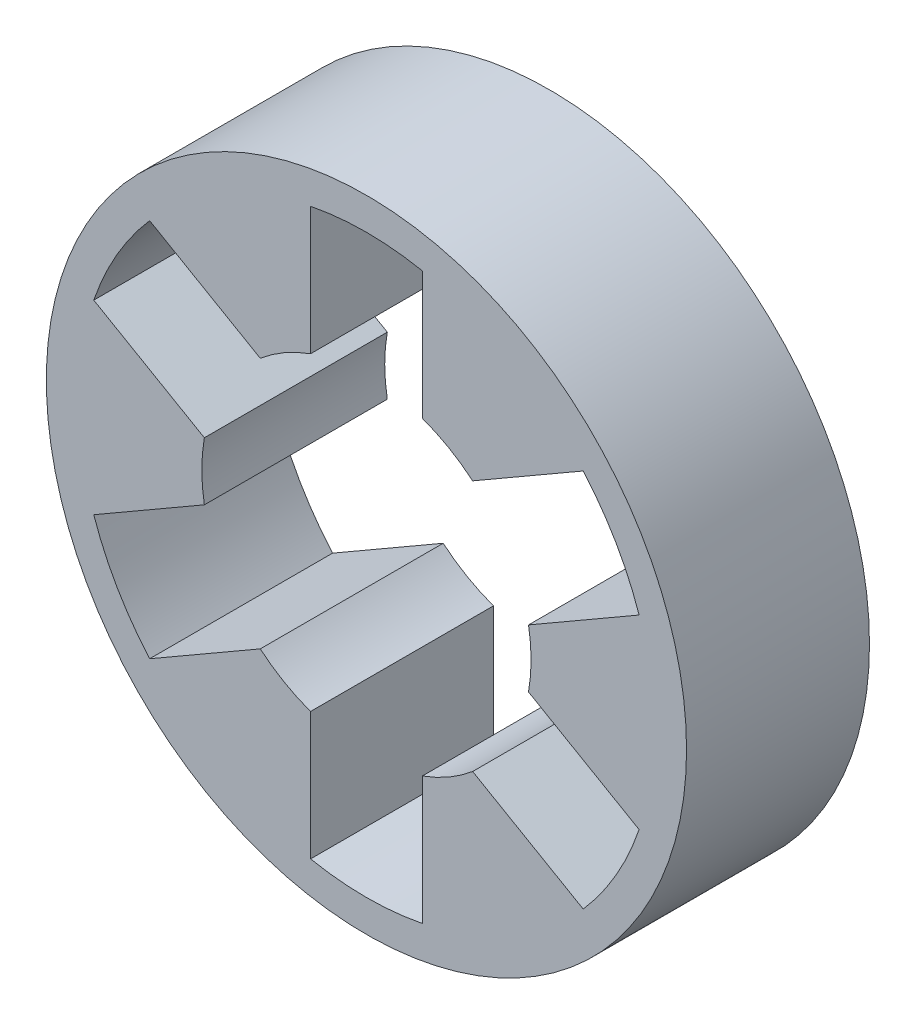
ISO-10303-21;
HEADER;
FILE_DESCRIPTION(('STEP AP214'),'2;1');
FILE_NAME('part.step','',(''),(''),'','','');
FILE_SCHEMA(('AUTOMOTIVE_DESIGN { 1 0 10303 214 1 1 1 1 }'));
ENDSEC;
DATA;
#1=APPLICATION_CONTEXT('core data for automotive mechanical design processes');
#2=APPLICATION_PROTOCOL_DEFINITION('international standard','automotive_design',2000,#1);
#3=PRODUCT_CONTEXT('',#1,'mechanical');
#4=PRODUCT('Part','Part','',(#3));
#5=PRODUCT_RELATED_PRODUCT_CATEGORY('part','',(#4));
#6=PRODUCT_DEFINITION_FORMATION('','',#4);
#7=PRODUCT_DEFINITION_CONTEXT('part definition',#1,'design');
#8=PRODUCT_DEFINITION('design','',#6,#7);
#9=PRODUCT_DEFINITION_SHAPE('','',#8);
#10=(LENGTH_UNIT() NAMED_UNIT(*) SI_UNIT(.MILLI.,.METRE.));
#11=(NAMED_UNIT(*) PLANE_ANGLE_UNIT() SI_UNIT($,.RADIAN.));
#12=(NAMED_UNIT(*) SI_UNIT($,.STERADIAN.) SOLID_ANGLE_UNIT());
#13=UNCERTAINTY_MEASURE_WITH_UNIT(LENGTH_MEASURE(1.E-05),#10,'distance_accuracy_value','');
#14=(GEOMETRIC_REPRESENTATION_CONTEXT(3) GLOBAL_UNCERTAINTY_ASSIGNED_CONTEXT((#13)) GLOBAL_UNIT_ASSIGNED_CONTEXT((#10,
#11,#12)) REPRESENTATION_CONTEXT('',''));
#15=CARTESIAN_POINT('',(0.,0.,0.));
#16=DIRECTION('',(0.,0.,1.));
#17=DIRECTION('',(1.,0.,0.));
#18=AXIS2_PLACEMENT_3D('',#15,#16,#17);
#19=CARTESIAN_POINT('',(0.,0.,15.875));
#20=DIRECTION('',(0.,0.,-1.));
#21=DIRECTION('',(-1.,0.,0.));
#22=AXIS2_PLACEMENT_3D('',#19,#20,#21);
#23=CYLINDRICAL_SURFACE('',#22,14.29);
#24=DIRECTION('',(0.,0.,-1.));
#25=VECTOR('',#24,1.);
#26=CARTESIAN_POINT('',(4.849999952,13.4417856129906,15.875));
#27=LINE('',#26,#25);
#28=CARTESIAN_POINT('',(4.849999952,13.4417856129906,0.));
#29=VERTEX_POINT('',#28);
#30=CARTESIAN_POINT('',(4.849999952,13.4417856129906,15.875));
#31=VERTEX_POINT('',#30);
#32=EDGE_CURVE('E11',#29,#31,#27,.F.);
#33=ORIENTED_EDGE('',*,*,#32,.F.);
#34=CARTESIAN_POINT('',(0.,0.,0.));
#35=DIRECTION('',(0.,0.,1.));
#36=DIRECTION('',(1.,0.,0.));
#37=AXIS2_PLACEMENT_3D('',#34,#35,#36);
#38=CIRCLE('',#37,14.29);
#39=CARTESIAN_POINT('',(9.21592783707634,10.9211159732786,0.));
#40=VERTEX_POINT('',#39);
#41=EDGE_CURVE('E333',#40,#29,#38,.T.);
#42=ORIENTED_EDGE('',*,*,#41,.F.);
#43=DIRECTION('',(0.,0.,-1.));
#44=VECTOR('',#43,1.);
#45=CARTESIAN_POINT('',(9.21592783707634,10.9211159732786,15.875));
#46=LINE('',#45,#44);
#47=CARTESIAN_POINT('',(9.21592783707634,10.9211159732786,15.875));
#48=VERTEX_POINT('',#47);
#49=EDGE_CURVE('E41',#48,#40,#46,.T.);
#50=ORIENTED_EDGE('',*,*,#49,.F.);
#51=CARTESIAN_POINT('',(0.,0.,15.875));
#52=DIRECTION('',(0.,0.,1.));
#53=DIRECTION('',(1.,0.,0.));
#54=AXIS2_PLACEMENT_3D('',#51,#52,#53);
#55=CIRCLE('',#54,14.29);
#56=EDGE_CURVE('E334',#48,#31,#55,.T.);
#57=ORIENTED_EDGE('',*,*,#56,.T.);
#58=EDGE_LOOP('',(#33,#42,#50,#57));
#59=FACE_BOUND('',#58,.T.);
#60=ADVANCED_FACE('F33',(#59),#23,.F.);
#61=DIRECTION('',(0.,0.,-1.));
#62=VECTOR('',#61,1.);
#63=CARTESIAN_POINT('',(14.0659278070769,2.52066953924941,15.875));
#64=LINE('',#63,#62);
#65=CARTESIAN_POINT('',(14.0659278070769,2.52066953924941,0.));
#66=VERTEX_POINT('',#65);
#67=CARTESIAN_POINT('',(14.0659278070769,2.52066953924941,15.875));
#68=VERTEX_POINT('',#67);
#69=EDGE_CURVE('E361',#66,#68,#64,.F.);
#70=ORIENTED_EDGE('',*,*,#69,.F.);
#71=CARTESIAN_POINT('',(14.0659278070768,-2.52066953925005,0.));
#72=VERTEX_POINT('',#71);
#73=EDGE_CURVE('E304',#72,#66,#38,.T.);
#74=ORIENTED_EDGE('',*,*,#73,.F.);
#75=DIRECTION('',(0.,0.,-1.));
#76=VECTOR('',#75,1.);
#77=CARTESIAN_POINT('',(14.0659278070768,-2.52066953925005,15.875));
#78=LINE('',#77,#76);
#79=CARTESIAN_POINT('',(14.0659278070768,-2.52066953925005,15.875));
#80=VERTEX_POINT('',#79);
#81=EDGE_CURVE('E359',#80,#72,#78,.T.);
#82=ORIENTED_EDGE('',*,*,#81,.F.);
#83=EDGE_CURVE('E329',#80,#68,#55,.T.);
#84=ORIENTED_EDGE('',*,*,#83,.T.);
#85=EDGE_LOOP('',(#70,#74,#82,#84));
#86=FACE_BOUND('',#85,.T.);
#87=ADVANCED_FACE('F406',(#86),#23,.F.);
#88=DIRECTION('',(0.,0.,-1.));
#89=VECTOR('',#88,1.);
#90=CARTESIAN_POINT('',(9.21592783707584,-10.921115973279,15.875));
#91=LINE('',#90,#89);
#92=CARTESIAN_POINT('',(9.21592783707584,-10.921115973279,0.));
#93=VERTEX_POINT('',#92);
#94=CARTESIAN_POINT('',(9.21592783707584,-10.921115973279,15.875));
#95=VERTEX_POINT('',#94);
#96=EDGE_CURVE('E357',#93,#95,#91,.F.);
#97=ORIENTED_EDGE('',*,*,#96,.F.);
#98=CARTESIAN_POINT('',(4.84999995199999,-13.4417856129906,0.));
#99=VERTEX_POINT('',#98);
#100=EDGE_CURVE('E337',#99,#93,#38,.T.);
#101=ORIENTED_EDGE('',*,*,#100,.F.);
#102=DIRECTION('',(0.,0.,-1.));
#103=VECTOR('',#102,1.);
#104=CARTESIAN_POINT('',(4.84999995199999,-13.4417856129906,15.875));
#105=LINE('',#104,#103);
#106=CARTESIAN_POINT('',(4.84999995199999,-13.4417856129906,15.875));
#107=VERTEX_POINT('',#106);
#108=EDGE_CURVE('E355',#107,#99,#105,.T.);
#109=ORIENTED_EDGE('',*,*,#108,.F.);
#110=EDGE_CURVE('E332',#107,#95,#55,.T.);
#111=ORIENTED_EDGE('',*,*,#110,.T.);
#112=EDGE_LOOP('',(#97,#101,#109,#111));
#113=FACE_BOUND('',#112,.T.);
#114=ADVANCED_FACE('F385',(#113),#23,.F.);
#115=DIRECTION('',(0.,0.,-1.));
#116=VECTOR('',#115,1.);
#117=CARTESIAN_POINT('',(-4.85000004799999,-13.4417855783523,15.875));
#118=LINE('',#117,#116);
#119=CARTESIAN_POINT('',(-4.85000004799999,-13.4417855783523,0.));
#120=VERTEX_POINT('',#119);
#121=CARTESIAN_POINT('',(-4.85000004799999,-13.4417855783523,15.875));
#122=VERTEX_POINT('',#121);
#123=EDGE_CURVE('E353',#120,#122,#118,.F.);
#124=ORIENTED_EDGE('',*,*,#123,.F.);
#125=CARTESIAN_POINT('',(-9.21592775907407,-10.9211160391019,0.));
#126=VERTEX_POINT('',#125);
#127=EDGE_CURVE('E376',#126,#120,#38,.T.);
#128=ORIENTED_EDGE('',*,*,#127,.F.);
#129=DIRECTION('',(0.,0.,-1.));
#130=VECTOR('',#129,1.);
#131=CARTESIAN_POINT('',(-9.21592775907407,-10.9211160391019,15.875));
#132=LINE('',#131,#130);
#133=CARTESIAN_POINT('',(-9.21592775907407,-10.9211160391019,15.875));
#134=VERTEX_POINT('',#133);
#135=EDGE_CURVE('E351',#134,#126,#132,.T.);
#136=ORIENTED_EDGE('',*,*,#135,.F.);
#137=EDGE_CURVE('E467',#134,#122,#55,.T.);
#138=ORIENTED_EDGE('',*,*,#137,.T.);
#139=EDGE_LOOP('',(#124,#128,#136,#138));
#140=FACE_BOUND('',#139,.T.);
#141=ADVANCED_FACE('F441',(#140),#23,.F.);
#142=DIRECTION('',(0.,0.,-1.));
#143=VECTOR('',#142,1.);
#144=CARTESIAN_POINT('',(-14.0659277890735,-2.52066963971298,15.875));
#145=LINE('',#144,#143);
#146=CARTESIAN_POINT('',(-14.0659277890735,-2.52066963971298,0.));
#147=VERTEX_POINT('',#146);
#148=CARTESIAN_POINT('',(-14.0659277890735,-2.52066963971298,15.875));
#149=VERTEX_POINT('',#148);
#150=EDGE_CURVE('E349',#147,#149,#145,.F.);
#151=ORIENTED_EDGE('',*,*,#150,.F.);
#152=CARTESIAN_POINT('',(-14.0659277890736,2.52066963971233,0.));
#153=VERTEX_POINT('',#152);
#154=EDGE_CURVE('E374',#153,#147,#38,.T.);
#155=ORIENTED_EDGE('',*,*,#154,.F.);
#156=DIRECTION('',(0.,0.,-1.));
#157=VECTOR('',#156,1.);
#158=CARTESIAN_POINT('',(-14.0659277890736,2.52066963971233,15.875));
#159=LINE('',#158,#157);
#160=CARTESIAN_POINT('',(-14.0659277890736,2.52066963971233,15.875));
#161=VERTEX_POINT('',#160);
#162=EDGE_CURVE('E347',#161,#153,#159,.T.);
#163=ORIENTED_EDGE('',*,*,#162,.F.);
#164=EDGE_CURVE('E452',#161,#149,#55,.T.);
#165=ORIENTED_EDGE('',*,*,#164,.T.);
#166=EDGE_LOOP('',(#151,#155,#163,#165));
#167=FACE_BOUND('',#166,.T.);
#168=ADVANCED_FACE('F431',(#167),#23,.F.);
#169=CARTESIAN_POINT('',(0.,0.,15.875));
#170=DIRECTION('',(0.,0.,1.));
#171=DIRECTION('',(1.,0.,0.));
#172=AXIS2_PLACEMENT_3D('',#169,#170,#171);
#173=PLANE('',#172);
#174=DIRECTION('',(-0.866025403784439,-0.5,0.));
#175=VECTOR('',#174,1.);
#176=CARTESIAN_POINT('',(4.849999952,8.4004463335673,15.875));
#177=LINE('',#176,#175);
#178=CARTESIAN_POINT('',(18.8143061649564,16.462742284664,15.875));
#179=VERTEX_POINT('',#178);
#180=EDGE_CURVE('E222',#179,#48,#177,.T.);
#181=ORIENTED_EDGE('',*,*,#180,.F.);
#182=CARTESIAN_POINT('',(0.,0.,15.875));
#183=DIRECTION('',(0.,0.,1.));
#184=DIRECTION('',(1.,0.,0.));
#185=AXIS2_PLACEMENT_3D('',#182,#183,#184);
#186=CIRCLE('',#185,24.9999999999996);
#187=CARTESIAN_POINT('',(23.6643061485142,8.06229585846208,15.875));
#188=VERTEX_POINT('',#187);
#189=EDGE_CURVE('E298',#188,#179,#186,.T.);
#190=ORIENTED_EDGE('',*,*,#189,.F.);
#191=DIRECTION('',(0.866025403784439,0.499999999999999,0.));
#192=VECTOR('',#191,1.);
#193=CARTESIAN_POINT('',(9.7000000960051,-3.52148865623292E-13,15.875));
#194=LINE('',#193,#192);
#195=EDGE_CURVE('E296',#68,#188,#194,.T.);
#196=ORIENTED_EDGE('',*,*,#195,.F.);
#197=ORIENTED_EDGE('',*,*,#83,.F.);
#198=DIRECTION('',(-0.866025403784439,0.499999999999999,0.));
#199=VECTOR('',#198,1.);
#200=CARTESIAN_POINT('',(23.664306148514,-8.06229585846266,15.875));
#201=LINE('',#200,#199);
#202=CARTESIAN_POINT('',(23.664306148514,-8.06229585846267,15.875));
#203=VERTEX_POINT('',#202);
#204=EDGE_CURVE('E294',#203,#80,#201,.T.);
#205=ORIENTED_EDGE('',*,*,#204,.F.);
#206=CARTESIAN_POINT('',(0.,0.,15.875));
#207=DIRECTION('',(0.,0.,1.));
#208=DIRECTION('',(1.,0.,0.));
#209=AXIS2_PLACEMENT_3D('',#206,#207,#208);
#210=CIRCLE('',#209,24.9999999999996);
#211=CARTESIAN_POINT('',(18.814306164956,-16.4627422846645,15.875));
#212=VERTEX_POINT('',#211);
#213=EDGE_CURVE('E291',#212,#203,#210,.T.);
#214=ORIENTED_EDGE('',*,*,#213,.F.);
#215=DIRECTION('',(0.866025403784439,-0.5,0.));
#216=VECTOR('',#215,1.);
#217=CARTESIAN_POINT('',(18.814306164956,-16.4627422846645,15.875));
#218=LINE('',#217,#216);
#219=EDGE_CURVE('E289',#95,#212,#218,.T.);
#220=ORIENTED_EDGE('',*,*,#219,.F.);
#221=ORIENTED_EDGE('',*,*,#110,.F.);
#222=DIRECTION('',(0.,1.,0.));
#223=VECTOR('',#222,1.);
#224=CARTESIAN_POINT('',(4.84999995200001,-8.40044633356802,15.875));
#225=LINE('',#224,#223);
#226=CARTESIAN_POINT('',(4.84999995199995,-24.5250382357619,15.875));
#227=VERTEX_POINT('',#226);
#228=EDGE_CURVE('E287',#227,#107,#225,.T.);
#229=ORIENTED_EDGE('',*,*,#228,.F.);
#230=CARTESIAN_POINT('',(0.,0.,15.875));
#231=DIRECTION('',(0.,0.,1.));
#232=DIRECTION('',(1.,0.,0.));
#233=AXIS2_PLACEMENT_3D('',#230,#231,#232);
#234=CIRCLE('',#233,24.9999999999996);
#235=CARTESIAN_POINT('',(-4.85000004799999,-24.5250382167772,15.875));
#236=VERTEX_POINT('',#235);
#237=EDGE_CURVE('E284',#236,#227,#234,.T.);
#238=ORIENTED_EDGE('',*,*,#237,.F.);
#239=DIRECTION('',(0.,-1.,0.));
#240=VECTOR('',#239,1.);
#241=CARTESIAN_POINT('',(-4.85000004799999,-8.4004464998508,15.875));
#242=LINE('',#241,#240);
#243=EDGE_CURVE('E282',#122,#236,#242,.T.);
#244=ORIENTED_EDGE('',*,*,#243,.F.);
#245=ORIENTED_EDGE('',*,*,#137,.F.);
#246=DIRECTION('',(0.866025403784438,0.5,0.));
#247=VECTOR('',#246,1.);
#248=CARTESIAN_POINT('',(-18.8143061005113,-16.4627423583145,15.875));
#249=LINE('',#248,#247);
#250=CARTESIAN_POINT('',(-18.8143061005113,-16.4627423583145,15.875));
#251=VERTEX_POINT('',#250);
#252=EDGE_CURVE('E280',#251,#134,#249,.T.);
#253=ORIENTED_EDGE('',*,*,#252,.F.);
#254=CARTESIAN_POINT('',(0.,0.,15.875));
#255=DIRECTION('',(0.,0.,1.));
#256=DIRECTION('',(1.,0.,0.));
#257=AXIS2_PLACEMENT_3D('',#254,#255,#256);
#258=CIRCLE('',#257,24.9999999999996);
#259=CARTESIAN_POINT('',(-23.6643061169535,-8.06229595109839,15.875));
#260=VERTEX_POINT('',#259);
#261=EDGE_CURVE('E277',#260,#251,#258,.T.);
#262=ORIENTED_EDGE('',*,*,#261,.F.);
#263=DIRECTION('',(-0.866025403784439,-0.5,0.));
#264=VECTOR('',#263,1.);
#265=CARTESIAN_POINT('',(-23.6643061169535,-8.06229595109839,15.875));
#266=LINE('',#265,#264);
#267=EDGE_CURVE('E275',#149,#260,#266,.T.);
#268=ORIENTED_EDGE('',*,*,#267,.F.);
#269=ORIENTED_EDGE('',*,*,#164,.F.);
#270=DIRECTION('',(0.866025403784439,-0.5,0.));
#271=VECTOR('',#270,1.);
#272=CARTESIAN_POINT('',(-9.69999990399488,-3.56485674313234E-13,15.875));
#273=LINE('',#272,#271);
#274=CARTESIAN_POINT('',(-23.6643061169537,8.06229595109779,15.875));
#275=VERTEX_POINT('',#274);
#276=EDGE_CURVE('E273',#275,#161,#273,.T.);
#277=ORIENTED_EDGE('',*,*,#276,.F.);
#278=CARTESIAN_POINT('',(0.,0.,15.875));
#279=DIRECTION('',(0.,0.,1.));
#280=DIRECTION('',(1.,0.,0.));
#281=AXIS2_PLACEMENT_3D('',#278,#279,#280);
#282=CIRCLE('',#281,24.9999999999996);
#283=CARTESIAN_POINT('',(-18.8143061005117,16.4627423583141,15.875));
#284=VERTEX_POINT('',#283);
#285=EDGE_CURVE('E270',#284,#275,#282,.T.);
#286=ORIENTED_EDGE('',*,*,#285,.F.);
#287=DIRECTION('',(-0.866025403784439,0.5,0.));
#288=VECTOR('',#287,1.);
#289=CARTESIAN_POINT('',(-4.85000004799998,8.40044649985007,15.875));
#290=LINE('',#289,#288);
#291=CARTESIAN_POINT('',(-9.21592775907458,10.9211160391014,15.875));
#292=VERTEX_POINT('',#291);
#293=EDGE_CURVE('E268',#292,#284,#290,.T.);
#294=ORIENTED_EDGE('',*,*,#293,.F.);
#295=CARTESIAN_POINT('',(-4.85000004799998,13.4417855783523,15.875));
#296=VERTEX_POINT('',#295);
#297=EDGE_CURVE('E515',#296,#292,#55,.T.);
#298=ORIENTED_EDGE('',*,*,#297,.F.);
#299=DIRECTION('',(0.,-1.,0.));
#300=VECTOR('',#299,1.);
#301=CARTESIAN_POINT('',(-4.85000004799999,24.5250382167772,15.875));
#302=LINE('',#301,#300);
#303=CARTESIAN_POINT('',(-4.85000004799999,24.5250382167772,15.875));
#304=VERTEX_POINT('',#303);
#305=EDGE_CURVE('E266',#304,#296,#302,.T.);
#306=ORIENTED_EDGE('',*,*,#305,.F.);
#307=CARTESIAN_POINT('',(0.,0.,15.875));
#308=DIRECTION('',(0.,0.,1.));
#309=DIRECTION('',(1.,0.,0.));
#310=AXIS2_PLACEMENT_3D('',#307,#308,#309);
#311=CIRCLE('',#310,24.9999999999996);
#312=CARTESIAN_POINT('',(4.849999952,24.5250382357619,15.875));
#313=VERTEX_POINT('',#312);
#314=EDGE_CURVE('E201',#313,#304,#311,.T.);
#315=ORIENTED_EDGE('',*,*,#314,.F.);
#316=DIRECTION('',(0.,1.,0.));
#317=VECTOR('',#316,1.);
#318=CARTESIAN_POINT('',(4.849999952,24.5250382357619,15.875));
#319=LINE('',#318,#317);
#320=EDGE_CURVE('E220',#31,#313,#319,.T.);
#321=ORIENTED_EDGE('',*,*,#320,.F.);
#322=ORIENTED_EDGE('',*,*,#56,.F.);
#323=EDGE_LOOP('',(#181,#190,#196,#197,#205,#214,#220,#221,#229,#238,#244,#245,#253,#262,#268,
#269,#277,#286,#294,#298,#306,#315,#321,#322));
#324=FACE_BOUND('',#323,.T.);
#325=CARTESIAN_POINT('',(0.,0.,15.875));
#326=DIRECTION('',(0.,0.,1.));
#327=DIRECTION('',(1.,0.,0.));
#328=AXIS2_PLACEMENT_3D('',#325,#326,#327);
#329=CIRCLE('',#328,27.78125);
#330=CARTESIAN_POINT('',(27.78125,0.,15.875));
#331=VERTEX_POINT('',#330);
#332=EDGE_CURVE('E338',#331,#331,#329,.T.);
#333=ORIENTED_EDGE('',*,*,#332,.T.);
#334=EDGE_LOOP('',(#333));
#335=FACE_BOUND('',#334,.T.);
#336=ADVANCED_FACE('F392',(#324,#335),#173,.T.);
#337=CARTESIAN_POINT('',(0.,0.,0.));
#338=DIRECTION('',(0.,0.,1.));
#339=DIRECTION('',(1.,0.,0.));
#340=AXIS2_PLACEMENT_3D('',#337,#338,#339);
#341=PLANE('',#340);
#342=CARTESIAN_POINT('',(0.,0.,0.));
#343=DIRECTION('',(0.,0.,1.));
#344=DIRECTION('',(1.,0.,0.));
#345=AXIS2_PLACEMENT_3D('',#342,#343,#344);
#346=CIRCLE('',#345,27.78125);
#347=CARTESIAN_POINT('',(27.78125,0.,0.));
#348=VERTEX_POINT('',#347);
#349=EDGE_CURVE('E341',#348,#348,#346,.T.);
#350=ORIENTED_EDGE('',*,*,#349,.F.);
#351=EDGE_LOOP('',(#350));
#352=FACE_BOUND('',#351,.T.);
#353=CARTESIAN_POINT('',(0.,0.,0.));
#354=DIRECTION('',(0.,0.,1.));
#355=DIRECTION('',(1.,0.,0.));
#356=AXIS2_PLACEMENT_3D('',#353,#354,#355);
#357=CIRCLE('',#356,24.9999999999996);
#358=CARTESIAN_POINT('',(23.6643061485142,8.06229585846208,0.));
#359=VERTEX_POINT('',#358);
#360=CARTESIAN_POINT('',(18.8143061649564,16.462742284664,0.));
#361=VERTEX_POINT('',#360);
#362=EDGE_CURVE('E259',#359,#361,#357,.T.);
#363=ORIENTED_EDGE('',*,*,#362,.T.);
#364=DIRECTION('',(-0.866025403784439,-0.5,0.));
#365=VECTOR('',#364,1.);
#366=CARTESIAN_POINT('',(4.849999952,8.4004463335673,0.));
#367=LINE('',#366,#365);
#368=EDGE_CURVE('E261',#361,#40,#367,.T.);
#369=ORIENTED_EDGE('',*,*,#368,.T.);
#370=ORIENTED_EDGE('',*,*,#41,.T.);
#371=DIRECTION('',(0.,1.,0.));
#372=VECTOR('',#371,1.);
#373=CARTESIAN_POINT('',(4.849999952,24.5250382357619,0.));
#374=LINE('',#373,#372);
#375=CARTESIAN_POINT('',(4.849999952,24.5250382357619,0.));
#376=VERTEX_POINT('',#375);
#377=EDGE_CURVE('E205',#29,#376,#374,.T.);
#378=ORIENTED_EDGE('',*,*,#377,.T.);
#379=CARTESIAN_POINT('',(0.,0.,0.));
#380=DIRECTION('',(0.,0.,1.));
#381=DIRECTION('',(1.,0.,0.));
#382=AXIS2_PLACEMENT_3D('',#379,#380,#381);
#383=CIRCLE('',#382,24.9999999999996);
#384=CARTESIAN_POINT('',(-4.85000004799999,24.5250382167772,0.));
#385=VERTEX_POINT('',#384);
#386=EDGE_CURVE('E198',#376,#385,#383,.T.);
#387=ORIENTED_EDGE('',*,*,#386,.T.);
#388=DIRECTION('',(0.,-1.,0.));
#389=VECTOR('',#388,1.);
#390=CARTESIAN_POINT('',(-4.85000004799999,24.5250382167772,0.));
#391=LINE('',#390,#389);
#392=CARTESIAN_POINT('',(-4.85000004799998,13.4417855783523,0.));
#393=VERTEX_POINT('',#392);
#394=EDGE_CURVE('E208',#385,#393,#391,.T.);
#395=ORIENTED_EDGE('',*,*,#394,.T.);
#396=CARTESIAN_POINT('',(-9.21592775907458,10.9211160391014,0.));
#397=VERTEX_POINT('',#396);
#398=EDGE_CURVE('E373',#393,#397,#38,.T.);
#399=ORIENTED_EDGE('',*,*,#398,.T.);
#400=DIRECTION('',(-0.866025403784439,0.5,0.));
#401=VECTOR('',#400,1.);
#402=CARTESIAN_POINT('',(-4.85000004799998,8.40044649985007,0.));
#403=LINE('',#402,#401);
#404=CARTESIAN_POINT('',(-18.8143061005117,16.4627423583141,0.));
#405=VERTEX_POINT('',#404);
#406=EDGE_CURVE('E215',#397,#405,#403,.T.);
#407=ORIENTED_EDGE('',*,*,#406,.T.);
#408=CARTESIAN_POINT('',(0.,0.,0.));
#409=DIRECTION('',(0.,0.,1.));
#410=DIRECTION('',(1.,0.,0.));
#411=AXIS2_PLACEMENT_3D('',#408,#409,#410);
#412=CIRCLE('',#411,24.9999999999996);
#413=CARTESIAN_POINT('',(-23.6643061169537,8.06229595109779,0.));
#414=VERTEX_POINT('',#413);
#415=EDGE_CURVE('E227',#405,#414,#412,.T.);
#416=ORIENTED_EDGE('',*,*,#415,.T.);
#417=DIRECTION('',(0.866025403784439,-0.5,0.));
#418=VECTOR('',#417,1.);
#419=CARTESIAN_POINT('',(-9.69999990399488,-3.56485674313234E-13,0.));
#420=LINE('',#419,#418);
#421=EDGE_CURVE('E230',#414,#153,#420,.T.);
#422=ORIENTED_EDGE('',*,*,#421,.T.);
#423=ORIENTED_EDGE('',*,*,#154,.T.);
#424=DIRECTION('',(-0.866025403784439,-0.5,0.));
#425=VECTOR('',#424,1.);
#426=CARTESIAN_POINT('',(-23.6643061169535,-8.06229595109839,0.));
#427=LINE('',#426,#425);
#428=CARTESIAN_POINT('',(-23.6643061169535,-8.06229595109839,0.));
#429=VERTEX_POINT('',#428);
#430=EDGE_CURVE('E233',#147,#429,#427,.T.);
#431=ORIENTED_EDGE('',*,*,#430,.T.);
#432=CARTESIAN_POINT('',(0.,0.,0.));
#433=DIRECTION('',(0.,0.,1.));
#434=DIRECTION('',(1.,0.,0.));
#435=AXIS2_PLACEMENT_3D('',#432,#433,#434);
#436=CIRCLE('',#435,24.9999999999996);
#437=CARTESIAN_POINT('',(-18.8143061005113,-16.4627423583145,0.));
#438=VERTEX_POINT('',#437);
#439=EDGE_CURVE('E236',#429,#438,#436,.T.);
#440=ORIENTED_EDGE('',*,*,#439,.T.);
#441=DIRECTION('',(0.866025403784438,0.5,0.));
#442=VECTOR('',#441,1.);
#443=CARTESIAN_POINT('',(-18.8143061005113,-16.4627423583145,0.));
#444=LINE('',#443,#442);
#445=EDGE_CURVE('E239',#438,#126,#444,.T.);
#446=ORIENTED_EDGE('',*,*,#445,.T.);
#447=ORIENTED_EDGE('',*,*,#127,.T.);
#448=DIRECTION('',(0.,-1.,0.));
#449=VECTOR('',#448,1.);
#450=CARTESIAN_POINT('',(-4.85000004799999,-8.4004464998508,0.));
#451=LINE('',#450,#449);
#452=CARTESIAN_POINT('',(-4.85000004799999,-24.5250382167772,0.));
#453=VERTEX_POINT('',#452);
#454=EDGE_CURVE('E56',#120,#453,#451,.T.);
#455=ORIENTED_EDGE('',*,*,#454,.T.);
#456=CARTESIAN_POINT('',(0.,0.,0.));
#457=DIRECTION('',(0.,0.,1.));
#458=DIRECTION('',(1.,0.,0.));
#459=AXIS2_PLACEMENT_3D('',#456,#457,#458);
#460=CIRCLE('',#459,24.9999999999996);
#461=CARTESIAN_POINT('',(4.84999995199995,-24.5250382357619,0.));
#462=VERTEX_POINT('',#461);
#463=EDGE_CURVE('E243',#453,#462,#460,.T.);
#464=ORIENTED_EDGE('',*,*,#463,.T.);
#465=DIRECTION('',(0.,1.,0.));
#466=VECTOR('',#465,1.);
#467=CARTESIAN_POINT('',(4.84999995200001,-8.40044633356802,0.));
#468=LINE('',#467,#466);
#469=EDGE_CURVE('E246',#462,#99,#468,.T.);
#470=ORIENTED_EDGE('',*,*,#469,.T.);
#471=ORIENTED_EDGE('',*,*,#100,.T.);
#472=DIRECTION('',(0.866025403784439,-0.5,0.));
#473=VECTOR('',#472,1.);
#474=CARTESIAN_POINT('',(18.814306164956,-16.4627422846645,0.));
#475=LINE('',#474,#473);
#476=CARTESIAN_POINT('',(18.814306164956,-16.4627422846645,0.));
#477=VERTEX_POINT('',#476);
#478=EDGE_CURVE('E48',#93,#477,#475,.T.);
#479=ORIENTED_EDGE('',*,*,#478,.T.);
#480=CARTESIAN_POINT('',(0.,0.,0.));
#481=DIRECTION('',(0.,0.,1.));
#482=DIRECTION('',(1.,0.,0.));
#483=AXIS2_PLACEMENT_3D('',#480,#481,#482);
#484=CIRCLE('',#483,24.9999999999996);
#485=CARTESIAN_POINT('',(23.664306148514,-8.06229585846267,0.));
#486=VERTEX_POINT('',#485);
#487=EDGE_CURVE('E250',#477,#486,#484,.T.);
#488=ORIENTED_EDGE('',*,*,#487,.T.);
#489=DIRECTION('',(-0.866025403784439,0.499999999999999,0.));
#490=VECTOR('',#489,1.);
#491=CARTESIAN_POINT('',(23.664306148514,-8.06229585846266,0.));
#492=LINE('',#491,#490);
#493=EDGE_CURVE('E253',#486,#72,#492,.T.);
#494=ORIENTED_EDGE('',*,*,#493,.T.);
#495=ORIENTED_EDGE('',*,*,#73,.T.);
#496=DIRECTION('',(0.866025403784439,0.499999999999999,0.));
#497=VECTOR('',#496,1.);
#498=CARTESIAN_POINT('',(9.7000000960051,-3.52148865623292E-13,0.));
#499=LINE('',#498,#497);
#500=EDGE_CURVE('E256',#66,#359,#499,.T.);
#501=ORIENTED_EDGE('',*,*,#500,.T.);
#502=EDGE_LOOP('',(#363,#369,#370,#378,#387,#395,#399,#407,#416,#422,#423,#431,#440,#446,#447,
#455,#464,#470,#471,#479,#488,#494,#495,#501));
#503=FACE_BOUND('',#502,.T.);
#504=ADVANCED_FACE('F218',(#352,#503),#341,.F.);
#505=CARTESIAN_POINT('',(0.,0.,15.875));
#506=DIRECTION('',(0.,0.,-1.));
#507=DIRECTION('',(-1.,0.,0.));
#508=AXIS2_PLACEMENT_3D('',#505,#506,#507);
#509=CYLINDRICAL_SURFACE('',#508,27.78125);
#510=ORIENTED_EDGE('',*,*,#332,.F.);
#511=EDGE_LOOP('',(#510));
#512=FACE_BOUND('',#511,.T.);
#513=ORIENTED_EDGE('',*,*,#349,.T.);
#514=EDGE_LOOP('',(#513));
#515=FACE_BOUND('',#514,.T.);
#516=ADVANCED_FACE('F35',(#512,#515),#509,.T.);
#517=DIRECTION('',(0.,0.,-1.));
#518=VECTOR('',#517,1.);
#519=CARTESIAN_POINT('',(-9.21592775907458,10.9211160391014,15.875));
#520=LINE('',#519,#518);
#521=EDGE_CURVE('E345',#397,#292,#520,.F.);
#522=ORIENTED_EDGE('',*,*,#521,.F.);
#523=ORIENTED_EDGE('',*,*,#398,.F.);
#524=DIRECTION('',(0.,0.,-1.));
#525=VECTOR('',#524,1.);
#526=CARTESIAN_POINT('',(-4.85000004799998,13.4417855783523,15.875));
#527=LINE('',#526,#525);
#528=EDGE_CURVE('E211',#296,#393,#527,.T.);
#529=ORIENTED_EDGE('',*,*,#528,.F.);
#530=ORIENTED_EDGE('',*,*,#297,.T.);
#531=EDGE_LOOP('',(#522,#523,#529,#530));
#532=FACE_BOUND('',#531,.T.);
#533=ADVANCED_FACE('F423',(#532),#23,.F.);
#534=CARTESIAN_POINT('',(-4.85000004799999,24.5250382167772,0.));
#535=DIRECTION('',(-1.,0.,0.));
#536=DIRECTION('',(0.,-1.,0.));
#537=AXIS2_PLACEMENT_3D('',#534,#535,#536);
#538=PLANE('',#537);
#539=ORIENTED_EDGE('',*,*,#528,.T.);
#540=ORIENTED_EDGE('',*,*,#394,.F.);
#541=DIRECTION('',(0.,0.,1.));
#542=VECTOR('',#541,1.);
#543=CARTESIAN_POINT('',(-4.85000004799999,24.5250382167772,0.));
#544=LINE('',#543,#542);
#545=EDGE_CURVE('E193',#385,#304,#544,.T.);
#546=ORIENTED_EDGE('',*,*,#545,.T.);
#547=ORIENTED_EDGE('',*,*,#305,.T.);
#548=EDGE_LOOP('',(#539,#540,#546,#547));
#549=FACE_BOUND('',#548,.T.);
#550=ADVANCED_FACE('F209',(#549),#538,.F.);
#551=CARTESIAN_POINT('',(4.849999952,24.5250382357619,0.));
#552=DIRECTION('',(1.,0.,0.));
#553=DIRECTION('',(0.,1.,0.));
#554=AXIS2_PLACEMENT_3D('',#551,#552,#553);
#555=PLANE('',#554);
#556=ORIENTED_EDGE('',*,*,#32,.T.);
#557=ORIENTED_EDGE('',*,*,#320,.T.);
#558=DIRECTION('',(0.,0.,1.));
#559=VECTOR('',#558,1.);
#560=CARTESIAN_POINT('',(4.849999952,24.5250382357619,0.));
#561=LINE('',#560,#559);
#562=EDGE_CURVE('E302',#376,#313,#561,.T.);
#563=ORIENTED_EDGE('',*,*,#562,.F.);
#564=ORIENTED_EDGE('',*,*,#377,.F.);
#565=EDGE_LOOP('',(#556,#557,#563,#564));
#566=FACE_BOUND('',#565,.T.);
#567=ADVANCED_FACE('F436',(#566),#555,.F.);
#568=CARTESIAN_POINT('',(0.,0.,0.));
#569=DIRECTION('',(0.,0.,1.));
#570=DIRECTION('',(1.,0.,0.));
#571=AXIS2_PLACEMENT_3D('',#568,#569,#570);
#572=CYLINDRICAL_SURFACE('',#571,24.9999999999996);
#573=ORIENTED_EDGE('',*,*,#314,.T.);
#574=ORIENTED_EDGE('',*,*,#545,.F.);
#575=ORIENTED_EDGE('',*,*,#386,.F.);
#576=ORIENTED_EDGE('',*,*,#562,.T.);
#577=EDGE_LOOP('',(#573,#574,#575,#576));
#578=FACE_BOUND('',#577,.T.);
#579=ADVANCED_FACE('F195',(#578),#572,.F.);
#580=CARTESIAN_POINT('',(-9.69999990399488,-3.56485674313234E-13,0.));
#581=DIRECTION('',(-0.5,-0.866025403784439,0.));
#582=DIRECTION('',(0.866025403784439,-0.5,0.));
#583=AXIS2_PLACEMENT_3D('',#580,#581,#582);
#584=PLANE('',#583);
#585=ORIENTED_EDGE('',*,*,#162,.T.);
#586=ORIENTED_EDGE('',*,*,#421,.F.);
#587=DIRECTION('',(0.,0.,1.));
#588=VECTOR('',#587,1.);
#589=CARTESIAN_POINT('',(-23.6643061169537,8.06229595109779,0.));
#590=LINE('',#589,#588);
#591=EDGE_CURVE('E325',#414,#275,#590,.T.);
#592=ORIENTED_EDGE('',*,*,#591,.T.);
#593=ORIENTED_EDGE('',*,*,#276,.T.);
#594=EDGE_LOOP('',(#585,#586,#592,#593));
#595=FACE_BOUND('',#594,.T.);
#596=ADVANCED_FACE('F496',(#595),#584,.F.);
#597=CARTESIAN_POINT('',(-4.85000004799998,8.40044649985007,0.));
#598=DIRECTION('',(0.5,0.866025403784439,0.));
#599=DIRECTION('',(-0.866025403784439,0.5,0.));
#600=AXIS2_PLACEMENT_3D('',#597,#598,#599);
#601=PLANE('',#600);
#602=ORIENTED_EDGE('',*,*,#521,.T.);
#603=ORIENTED_EDGE('',*,*,#293,.T.);
#604=DIRECTION('',(0.,0.,1.));
#605=VECTOR('',#604,1.);
#606=CARTESIAN_POINT('',(-18.8143061005117,16.4627423583141,0.));
#607=LINE('',#606,#605);
#608=EDGE_CURVE('E204',#405,#284,#607,.T.);
#609=ORIENTED_EDGE('',*,*,#608,.F.);
#610=ORIENTED_EDGE('',*,*,#406,.F.);
#611=EDGE_LOOP('',(#602,#603,#609,#610));
#612=FACE_BOUND('',#611,.T.);
#613=ADVANCED_FACE('F499',(#612),#601,.F.);
#614=CARTESIAN_POINT('',(0.,0.,0.));
#615=DIRECTION('',(0.,0.,1.));
#616=DIRECTION('',(1.,0.,0.));
#617=AXIS2_PLACEMENT_3D('',#614,#615,#616);
#618=CYLINDRICAL_SURFACE('',#617,24.9999999999996);
#619=ORIENTED_EDGE('',*,*,#285,.T.);
#620=ORIENTED_EDGE('',*,*,#591,.F.);
#621=ORIENTED_EDGE('',*,*,#415,.F.);
#622=ORIENTED_EDGE('',*,*,#608,.T.);
#623=EDGE_LOOP('',(#619,#620,#621,#622));
#624=FACE_BOUND('',#623,.T.);
#625=ADVANCED_FACE('F492',(#624),#618,.F.);
#626=CARTESIAN_POINT('',(-18.8143061005113,-16.4627423583145,0.));
#627=DIRECTION('',(0.5,-0.866025403784438,0.));
#628=DIRECTION('',(0.866025403784438,0.5,0.));
#629=AXIS2_PLACEMENT_3D('',#626,#627,#628);
#630=PLANE('',#629);
#631=ORIENTED_EDGE('',*,*,#135,.T.);
#632=ORIENTED_EDGE('',*,*,#445,.F.);
#633=DIRECTION('',(0.,0.,1.));
#634=VECTOR('',#633,1.);
#635=CARTESIAN_POINT('',(-18.8143061005113,-16.4627423583145,0.));
#636=LINE('',#635,#634);
#637=EDGE_CURVE('E320',#438,#251,#636,.T.);
#638=ORIENTED_EDGE('',*,*,#637,.T.);
#639=ORIENTED_EDGE('',*,*,#252,.T.);
#640=EDGE_LOOP('',(#631,#632,#638,#639));
#641=FACE_BOUND('',#640,.T.);
#642=ADVANCED_FACE('F490',(#641),#630,.F.);
#643=CARTESIAN_POINT('',(-23.6643061169535,-8.06229595109839,0.));
#644=DIRECTION('',(-0.5,0.866025403784439,0.));
#645=DIRECTION('',(-0.866025403784439,-0.5,0.));
#646=AXIS2_PLACEMENT_3D('',#643,#644,#645);
#647=PLANE('',#646);
#648=ORIENTED_EDGE('',*,*,#150,.T.);
#649=ORIENTED_EDGE('',*,*,#267,.T.);
#650=DIRECTION('',(0.,0.,1.));
#651=VECTOR('',#650,1.);
#652=CARTESIAN_POINT('',(-23.6643061169535,-8.06229595109839,0.));
#653=LINE('',#652,#651);
#654=EDGE_CURVE('E322',#429,#260,#653,.T.);
#655=ORIENTED_EDGE('',*,*,#654,.F.);
#656=ORIENTED_EDGE('',*,*,#430,.F.);
#657=EDGE_LOOP('',(#648,#649,#655,#656));
#658=FACE_BOUND('',#657,.T.);
#659=ADVANCED_FACE('F455',(#658),#647,.F.);
#660=CARTESIAN_POINT('',(0.,0.,0.));
#661=DIRECTION('',(0.,0.,1.));
#662=DIRECTION('',(1.,0.,0.));
#663=AXIS2_PLACEMENT_3D('',#660,#661,#662);
#664=CYLINDRICAL_SURFACE('',#663,24.9999999999996);
#665=ORIENTED_EDGE('',*,*,#261,.T.);
#666=ORIENTED_EDGE('',*,*,#637,.F.);
#667=ORIENTED_EDGE('',*,*,#439,.F.);
#668=ORIENTED_EDGE('',*,*,#654,.T.);
#669=EDGE_LOOP('',(#665,#666,#667,#668));
#670=FACE_BOUND('',#669,.T.);
#671=ADVANCED_FACE('F461',(#670),#664,.F.);
#672=CARTESIAN_POINT('',(4.84999995200001,-8.40044633356802,0.));
#673=DIRECTION('',(1.,0.,0.));
#674=DIRECTION('',(0.,1.,0.));
#675=AXIS2_PLACEMENT_3D('',#672,#673,#674);
#676=PLANE('',#675);
#677=ORIENTED_EDGE('',*,*,#108,.T.);
#678=ORIENTED_EDGE('',*,*,#469,.F.);
#679=DIRECTION('',(0.,0.,1.));
#680=VECTOR('',#679,1.);
#681=CARTESIAN_POINT('',(4.84999995199995,-24.5250382357619,0.));
#682=LINE('',#681,#680);
#683=EDGE_CURVE('E315',#462,#227,#682,.T.);
#684=ORIENTED_EDGE('',*,*,#683,.T.);
#685=ORIENTED_EDGE('',*,*,#228,.T.);
#686=EDGE_LOOP('',(#677,#678,#684,#685));
#687=FACE_BOUND('',#686,.T.);
#688=ADVANCED_FACE('F475',(#687),#676,.F.);
#689=CARTESIAN_POINT('',(-4.85000004799999,-8.4004464998508,0.));
#690=DIRECTION('',(-1.,0.,0.));
#691=DIRECTION('',(0.,-1.,0.));
#692=AXIS2_PLACEMENT_3D('',#689,#690,#691);
#693=PLANE('',#692);
#694=ORIENTED_EDGE('',*,*,#123,.T.);
#695=ORIENTED_EDGE('',*,*,#243,.T.);
#696=DIRECTION('',(0.,0.,1.));
#697=VECTOR('',#696,1.);
#698=CARTESIAN_POINT('',(-4.85000004799999,-24.5250382167772,0.));
#699=LINE('',#698,#697);
#700=EDGE_CURVE('E317',#453,#236,#699,.T.);
#701=ORIENTED_EDGE('',*,*,#700,.F.);
#702=ORIENTED_EDGE('',*,*,#454,.F.);
#703=EDGE_LOOP('',(#694,#695,#701,#702));
#704=FACE_BOUND('',#703,.T.);
#705=ADVANCED_FACE('F469',(#704),#693,.F.);
#706=CARTESIAN_POINT('',(0.,0.,0.));
#707=DIRECTION('',(0.,0.,1.));
#708=DIRECTION('',(1.,0.,0.));
#709=AXIS2_PLACEMENT_3D('',#706,#707,#708);
#710=CYLINDRICAL_SURFACE('',#709,24.9999999999996);
#711=ORIENTED_EDGE('',*,*,#237,.T.);
#712=ORIENTED_EDGE('',*,*,#683,.F.);
#713=ORIENTED_EDGE('',*,*,#463,.F.);
#714=ORIENTED_EDGE('',*,*,#700,.T.);
#715=EDGE_LOOP('',(#711,#712,#713,#714));
#716=FACE_BOUND('',#715,.T.);
#717=ADVANCED_FACE('F472',(#716),#710,.F.);
#718=CARTESIAN_POINT('',(23.664306148514,-8.06229585846266,0.));
#719=DIRECTION('',(0.499999999999999,0.866025403784439,0.));
#720=DIRECTION('',(-0.866025403784439,0.499999999999999,0.));
#721=AXIS2_PLACEMENT_3D('',#718,#719,#720);
#722=PLANE('',#721);
#723=ORIENTED_EDGE('',*,*,#81,.T.);
#724=ORIENTED_EDGE('',*,*,#493,.F.);
#725=DIRECTION('',(0.,0.,1.));
#726=VECTOR('',#725,1.);
#727=CARTESIAN_POINT('',(23.664306148514,-8.06229585846267,0.));
#728=LINE('',#727,#726);
#729=EDGE_CURVE('E310',#486,#203,#728,.T.);
#730=ORIENTED_EDGE('',*,*,#729,.T.);
#731=ORIENTED_EDGE('',*,*,#204,.T.);
#732=EDGE_LOOP('',(#723,#724,#730,#731));
#733=FACE_BOUND('',#732,.T.);
#734=ADVANCED_FACE('F488',(#733),#722,.F.);
#735=CARTESIAN_POINT('',(18.814306164956,-16.4627422846645,0.));
#736=DIRECTION('',(-0.5,-0.866025403784439,0.));
#737=DIRECTION('',(0.866025403784439,-0.5,0.));
#738=AXIS2_PLACEMENT_3D('',#735,#736,#737);
#739=PLANE('',#738);
#740=ORIENTED_EDGE('',*,*,#96,.T.);
#741=ORIENTED_EDGE('',*,*,#219,.T.);
#742=DIRECTION('',(0.,0.,1.));
#743=VECTOR('',#742,1.);
#744=CARTESIAN_POINT('',(18.814306164956,-16.4627422846645,0.));
#745=LINE('',#744,#743);
#746=EDGE_CURVE('E312',#477,#212,#745,.T.);
#747=ORIENTED_EDGE('',*,*,#746,.F.);
#748=ORIENTED_EDGE('',*,*,#478,.F.);
#749=EDGE_LOOP('',(#740,#741,#747,#748));
#750=FACE_BOUND('',#749,.T.);
#751=ADVANCED_FACE('F389',(#750),#739,.F.);
#752=CARTESIAN_POINT('',(0.,0.,0.));
#753=DIRECTION('',(0.,0.,1.));
#754=DIRECTION('',(1.,0.,0.));
#755=AXIS2_PLACEMENT_3D('',#752,#753,#754);
#756=CYLINDRICAL_SURFACE('',#755,24.9999999999996);
#757=ORIENTED_EDGE('',*,*,#213,.T.);
#758=ORIENTED_EDGE('',*,*,#729,.F.);
#759=ORIENTED_EDGE('',*,*,#487,.F.);
#760=ORIENTED_EDGE('',*,*,#746,.T.);
#761=EDGE_LOOP('',(#757,#758,#759,#760));
#762=FACE_BOUND('',#761,.T.);
#763=ADVANCED_FACE('F398',(#762),#756,.F.);
#764=CARTESIAN_POINT('',(4.849999952,8.4004463335673,0.));
#765=DIRECTION('',(-0.5,0.866025403784439,0.));
#766=DIRECTION('',(-0.866025403784439,-0.5,0.));
#767=AXIS2_PLACEMENT_3D('',#764,#765,#766);
#768=PLANE('',#767);
#769=ORIENTED_EDGE('',*,*,#49,.T.);
#770=ORIENTED_EDGE('',*,*,#368,.F.);
#771=DIRECTION('',(0.,0.,1.));
#772=VECTOR('',#771,1.);
#773=CARTESIAN_POINT('',(18.8143061649564,16.462742284664,0.));
#774=LINE('',#773,#772);
#775=EDGE_CURVE('E305',#361,#179,#774,.T.);
#776=ORIENTED_EDGE('',*,*,#775,.T.);
#777=ORIENTED_EDGE('',*,*,#180,.T.);
#778=EDGE_LOOP('',(#769,#770,#776,#777));
#779=FACE_BOUND('',#778,.T.);
#780=ADVANCED_FACE('F365',(#779),#768,.F.);
#781=CARTESIAN_POINT('',(0.,0.,0.));
#782=DIRECTION('',(0.,0.,1.));
#783=DIRECTION('',(1.,0.,0.));
#784=AXIS2_PLACEMENT_3D('',#781,#782,#783);
#785=CYLINDRICAL_SURFACE('',#784,24.9999999999996);
#786=ORIENTED_EDGE('',*,*,#189,.T.);
#787=ORIENTED_EDGE('',*,*,#775,.F.);
#788=ORIENTED_EDGE('',*,*,#362,.F.);
#789=DIRECTION('',(0.,0.,1.));
#790=VECTOR('',#789,1.);
#791=CARTESIAN_POINT('',(23.6643061485142,8.06229585846208,0.));
#792=LINE('',#791,#790);
#793=EDGE_CURVE('E307',#359,#188,#792,.T.);
#794=ORIENTED_EDGE('',*,*,#793,.T.);
#795=EDGE_LOOP('',(#786,#787,#788,#794));
#796=FACE_BOUND('',#795,.T.);
#797=ADVANCED_FACE('F412',(#796),#785,.F.);
#798=CARTESIAN_POINT('',(9.7000000960051,-3.52148865623292E-13,0.));
#799=DIRECTION('',(0.499999999999999,-0.866025403784439,0.));
#800=DIRECTION('',(0.866025403784439,0.499999999999999,0.));
#801=AXIS2_PLACEMENT_3D('',#798,#799,#800);
#802=PLANE('',#801);
#803=ORIENTED_EDGE('',*,*,#69,.T.);
#804=ORIENTED_EDGE('',*,*,#195,.T.);
#805=ORIENTED_EDGE('',*,*,#793,.F.);
#806=ORIENTED_EDGE('',*,*,#500,.F.);
#807=EDGE_LOOP('',(#803,#804,#805,#806));
#808=FACE_BOUND('',#807,.T.);
#809=ADVANCED_FACE('F409',(#808),#802,.F.);
#810=CLOSED_SHELL('',(#60,#87,#114,#141,#168,#336,#504,#516,#533,#550,#567,#579,#596,#613,#625,
#642,#659,#671,#688,#705,#717,#734,#751,#763,#780,#797,#809));
#811=MANIFOLD_SOLID_BREP('B2',#810);
#812=ADVANCED_BREP_SHAPE_REPRESENTATION('',(#18,#811),#14);
#813=SHAPE_DEFINITION_REPRESENTATION(#9,#812);
ENDSEC;
END-ISO-10303-21;
